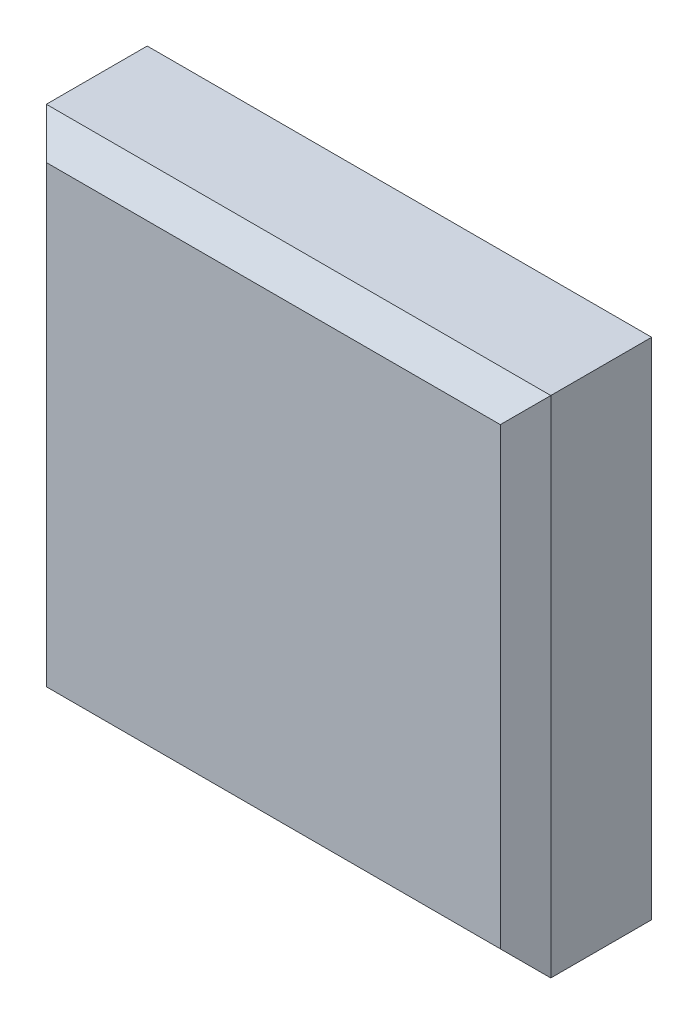
ISO-10303-21;
HEADER;
FILE_DESCRIPTION(('STEP AP214'),'2;1');
FILE_NAME('part.step','',(''),(''),'','','');
FILE_SCHEMA(('AUTOMOTIVE_DESIGN { 1 0 10303 214 1 1 1 1 }'));
ENDSEC;
DATA;
#1=APPLICATION_CONTEXT('core data for automotive mechanical design processes');
#2=APPLICATION_PROTOCOL_DEFINITION('international standard','automotive_design',2000,#1);
#3=PRODUCT_CONTEXT('',#1,'mechanical');
#4=PRODUCT('Part','Part','',(#3));
#5=PRODUCT_RELATED_PRODUCT_CATEGORY('part','',(#4));
#6=PRODUCT_DEFINITION_FORMATION('','',#4);
#7=PRODUCT_DEFINITION_CONTEXT('part definition',#1,'design');
#8=PRODUCT_DEFINITION('design','',#6,#7);
#9=PRODUCT_DEFINITION_SHAPE('','',#8);
#10=(LENGTH_UNIT() NAMED_UNIT(*) SI_UNIT(.MILLI.,.METRE.));
#11=(NAMED_UNIT(*) PLANE_ANGLE_UNIT() SI_UNIT($,.RADIAN.));
#12=(NAMED_UNIT(*) SI_UNIT($,.STERADIAN.) SOLID_ANGLE_UNIT());
#13=UNCERTAINTY_MEASURE_WITH_UNIT(LENGTH_MEASURE(1.E-05),#10,'distance_accuracy_value','');
#14=(GEOMETRIC_REPRESENTATION_CONTEXT(3) GLOBAL_UNCERTAINTY_ASSIGNED_CONTEXT((#13)) GLOBAL_UNIT_ASSIGNED_CONTEXT((#10,
#11,#12)) REPRESENTATION_CONTEXT('',''));
#15=CARTESIAN_POINT('',(0.,0.,0.));
#16=DIRECTION('',(0.,0.,1.));
#17=DIRECTION('',(1.,0.,0.));
#18=AXIS2_PLACEMENT_3D('',#15,#16,#17);
#19=CARTESIAN_POINT('',(0.,0.,5.));
#20=DIRECTION('',(1.,0.,0.));
#21=DIRECTION('',(0.,1.,0.));
#22=AXIS2_PLACEMENT_3D('',#19,#20,#21);
#23=PLANE('',#22);
#24=DIRECTION('',(0.,0.,-1.));
#25=VECTOR('',#24,1.);
#26=CARTESIAN_POINT('',(0.,-20.,5.));
#27=LINE('',#26,#25);
#28=CARTESIAN_POINT('',(0.,-20.,4.));
#29=VERTEX_POINT('',#28);
#30=CARTESIAN_POINT('',(0.,-20.,0.));
#31=VERTEX_POINT('',#30);
#32=EDGE_CURVE('E86',#29,#31,#27,.T.);
#33=ORIENTED_EDGE('',*,*,#32,.F.);
#34=DIRECTION('',(0.,1.,0.));
#35=VECTOR('',#34,1.);
#36=CARTESIAN_POINT('',(0.,0.,4.));
#37=LINE('',#36,#35);
#38=CARTESIAN_POINT('',(0.,0.,4.));
#39=VERTEX_POINT('',#38);
#40=EDGE_CURVE('E11',#29,#39,#37,.T.);
#41=ORIENTED_EDGE('',*,*,#40,.T.);
#42=DIRECTION('',(0.,0.,-1.));
#43=VECTOR('',#42,1.);
#44=CARTESIAN_POINT('',(0.,0.,5.));
#45=LINE('',#44,#43);
#46=CARTESIAN_POINT('',(0.,0.,0.));
#47=VERTEX_POINT('',#46);
#48=EDGE_CURVE('E106',#39,#47,#45,.T.);
#49=ORIENTED_EDGE('',*,*,#48,.T.);
#50=DIRECTION('',(0.,-1.,0.));
#51=VECTOR('',#50,1.);
#52=CARTESIAN_POINT('',(0.,0.,0.));
#53=LINE('',#52,#51);
#54=EDGE_CURVE('E101',#47,#31,#53,.T.);
#55=ORIENTED_EDGE('',*,*,#54,.T.);
#56=EDGE_LOOP('',(#33,#41,#49,#55));
#57=FACE_BOUND('',#56,.T.);
#58=ADVANCED_FACE('F34',(#57),#23,.F.);
#59=CARTESIAN_POINT('',(0.,-20.,5.));
#60=DIRECTION('',(0.,1.,0.));
#61=DIRECTION('',(0.,0.,1.));
#62=AXIS2_PLACEMENT_3D('',#59,#60,#61);
#63=PLANE('',#62);
#64=DIRECTION('',(0.,0.,-1.));
#65=VECTOR('',#64,1.);
#66=CARTESIAN_POINT('',(20.,-20.,5.));
#67=LINE('',#66,#65);
#68=CARTESIAN_POINT('',(20.,-20.,4.));
#69=VERTEX_POINT('',#68);
#70=CARTESIAN_POINT('',(20.,-20.,0.));
#71=VERTEX_POINT('',#70);
#72=EDGE_CURVE('E95',#69,#71,#67,.T.);
#73=ORIENTED_EDGE('',*,*,#72,.F.);
#74=DIRECTION('',(-1.,0.,0.));
#75=VECTOR('',#74,1.);
#76=CARTESIAN_POINT('',(0.,-20.,4.));
#77=LINE('',#76,#75);
#78=EDGE_CURVE('E43',#69,#29,#77,.T.);
#79=ORIENTED_EDGE('',*,*,#78,.T.);
#80=ORIENTED_EDGE('',*,*,#32,.T.);
#81=DIRECTION('',(1.,0.,0.));
#82=VECTOR('',#81,1.);
#83=CARTESIAN_POINT('',(0.,-20.,0.));
#84=LINE('',#83,#82);
#85=EDGE_CURVE('E89',#31,#71,#84,.T.);
#86=ORIENTED_EDGE('',*,*,#85,.T.);
#87=EDGE_LOOP('',(#73,#79,#80,#86));
#88=FACE_BOUND('',#87,.T.);
#89=ADVANCED_FACE('F88',(#88),#63,.F.);
#90=CARTESIAN_POINT('',(20.,0.,5.));
#91=DIRECTION('',(-1.,0.,0.));
#92=DIRECTION('',(0.,-1.,0.));
#93=AXIS2_PLACEMENT_3D('',#90,#91,#92);
#94=PLANE('',#93);
#95=DIRECTION('',(0.,0.,-1.));
#96=VECTOR('',#95,1.);
#97=CARTESIAN_POINT('',(20.,0.,5.));
#98=LINE('',#97,#96);
#99=CARTESIAN_POINT('',(20.,0.,4.));
#100=VERTEX_POINT('',#99);
#101=CARTESIAN_POINT('',(20.,0.,0.));
#102=VERTEX_POINT('',#101);
#103=EDGE_CURVE('E116',#100,#102,#98,.T.);
#104=ORIENTED_EDGE('',*,*,#103,.F.);
#105=DIRECTION('',(0.,-1.,0.));
#106=VECTOR('',#105,1.);
#107=CARTESIAN_POINT('',(20.,-20.,4.));
#108=LINE('',#107,#106);
#109=EDGE_CURVE('E58',#100,#69,#108,.T.);
#110=ORIENTED_EDGE('',*,*,#109,.T.);
#111=ORIENTED_EDGE('',*,*,#72,.T.);
#112=DIRECTION('',(0.,1.,0.));
#113=VECTOR('',#112,1.);
#114=CARTESIAN_POINT('',(20.,0.,0.));
#115=LINE('',#114,#113);
#116=EDGE_CURVE('E103',#71,#102,#115,.T.);
#117=ORIENTED_EDGE('',*,*,#116,.T.);
#118=EDGE_LOOP('',(#104,#110,#111,#117));
#119=FACE_BOUND('',#118,.T.);
#120=ADVANCED_FACE('F154',(#119),#94,.F.);
#121=CARTESIAN_POINT('',(0.,0.,5.));
#122=DIRECTION('',(0.,-1.,0.));
#123=DIRECTION('',(0.,0.,-1.));
#124=AXIS2_PLACEMENT_3D('',#121,#122,#123);
#125=PLANE('',#124);
#126=ORIENTED_EDGE('',*,*,#48,.F.);
#127=DIRECTION('',(1.,0.,0.));
#128=VECTOR('',#127,1.);
#129=CARTESIAN_POINT('',(20.,0.,4.));
#130=LINE('',#129,#128);
#131=EDGE_CURVE('E127',#39,#100,#130,.T.);
#132=ORIENTED_EDGE('',*,*,#131,.T.);
#133=ORIENTED_EDGE('',*,*,#103,.T.);
#134=DIRECTION('',(-1.,0.,0.));
#135=VECTOR('',#134,1.);
#136=CARTESIAN_POINT('',(0.,0.,0.));
#137=LINE('',#136,#135);
#138=EDGE_CURVE('E113',#102,#47,#137,.T.);
#139=ORIENTED_EDGE('',*,*,#138,.T.);
#140=EDGE_LOOP('',(#126,#132,#133,#139));
#141=FACE_BOUND('',#140,.T.);
#142=ADVANCED_FACE('F153',(#141),#125,.F.);
#143=CARTESIAN_POINT('',(0.,0.,5.));
#144=DIRECTION('',(0.,0.,1.));
#145=DIRECTION('',(1.,0.,0.));
#146=AXIS2_PLACEMENT_3D('',#143,#144,#145);
#147=PLANE('',#146);
#148=DIRECTION('',(0.,1.,0.));
#149=VECTOR('',#148,1.);
#150=CARTESIAN_POINT('',(19.,0.,5.));
#151=LINE('',#150,#149);
#152=CARTESIAN_POINT('',(19.,-19.,5.));
#153=VERTEX_POINT('',#152);
#154=CARTESIAN_POINT('',(19.,-1.,5.));
#155=VERTEX_POINT('',#154);
#156=EDGE_CURVE('E122',#153,#155,#151,.T.);
#157=ORIENTED_EDGE('',*,*,#156,.T.);
#158=DIRECTION('',(-1.,0.,0.));
#159=VECTOR('',#158,1.);
#160=CARTESIAN_POINT('',(0.,-1.,5.));
#161=LINE('',#160,#159);
#162=CARTESIAN_POINT('',(1.,-1.,5.));
#163=VERTEX_POINT('',#162);
#164=EDGE_CURVE('E124',#155,#163,#161,.T.);
#165=ORIENTED_EDGE('',*,*,#164,.T.);
#166=DIRECTION('',(0.,-1.,0.));
#167=VECTOR('',#166,1.);
#168=CARTESIAN_POINT('',(1.,-20.,5.));
#169=LINE('',#168,#167);
#170=CARTESIAN_POINT('',(1.,-19.,5.));
#171=VERTEX_POINT('',#170);
#172=EDGE_CURVE('E94',#163,#171,#169,.T.);
#173=ORIENTED_EDGE('',*,*,#172,.T.);
#174=DIRECTION('',(1.,0.,0.));
#175=VECTOR('',#174,1.);
#176=CARTESIAN_POINT('',(20.,-19.,5.));
#177=LINE('',#176,#175);
#178=EDGE_CURVE('E120',#171,#153,#177,.T.);
#179=ORIENTED_EDGE('',*,*,#178,.T.);
#180=EDGE_LOOP('',(#157,#165,#173,#179));
#181=FACE_BOUND('',#180,.T.);
#182=ADVANCED_FACE('F146',(#181),#147,.T.);
#183=CARTESIAN_POINT('',(0.,0.,0.));
#184=DIRECTION('',(0.,0.,1.));
#185=DIRECTION('',(1.,0.,0.));
#186=AXIS2_PLACEMENT_3D('',#183,#184,#185);
#187=PLANE('',#186);
#188=ORIENTED_EDGE('',*,*,#54,.F.);
#189=ORIENTED_EDGE('',*,*,#138,.F.);
#190=ORIENTED_EDGE('',*,*,#116,.F.);
#191=ORIENTED_EDGE('',*,*,#85,.F.);
#192=EDGE_LOOP('',(#188,#189,#190,#191));
#193=FACE_BOUND('',#192,.T.);
#194=ADVANCED_FACE('F99',(#193),#187,.F.);
#195=CARTESIAN_POINT('',(0.,-19.,5.));
#196=DIRECTION('',(0.,-0.707106781186549,0.707106781186546));
#197=DIRECTION('',(-1.,0.,0.));
#198=AXIS2_PLACEMENT_3D('',#195,#196,#197);
#199=PLANE('',#198);
#200=DIRECTION('',(0.577350269189625,0.577350269189625,0.577350269189627));
#201=VECTOR('',#200,1.);
#202=CARTESIAN_POINT('',(7.33333333333332,-12.6666666666667,11.3333333333333));
#203=LINE('',#202,#201);
#204=EDGE_CURVE('E110',#29,#171,#203,.T.);
#205=ORIENTED_EDGE('',*,*,#204,.F.);
#206=ORIENTED_EDGE('',*,*,#78,.F.);
#207=DIRECTION('',(-0.577350269189624,0.577350269189626,0.577350269189628));
#208=VECTOR('',#207,1.);
#209=CARTESIAN_POINT('',(12.6666666666667,-12.6666666666667,11.3333333333333));
#210=LINE('',#209,#208);
#211=EDGE_CURVE('E38',#153,#69,#210,.F.);
#212=ORIENTED_EDGE('',*,*,#211,.F.);
#213=ORIENTED_EDGE('',*,*,#178,.F.);
#214=EDGE_LOOP('',(#205,#206,#212,#213));
#215=FACE_BOUND('',#214,.T.);
#216=ADVANCED_FACE('F36',(#215),#199,.T.);
#217=CARTESIAN_POINT('',(19.,0.,5.));
#218=DIRECTION('',(0.70710678118655,0.,0.707106781186545));
#219=DIRECTION('',(0.,-1.,0.));
#220=AXIS2_PLACEMENT_3D('',#217,#218,#219);
#221=PLANE('',#220);
#222=ORIENTED_EDGE('',*,*,#211,.T.);
#223=ORIENTED_EDGE('',*,*,#109,.F.);
#224=DIRECTION('',(-0.577350269189624,-0.577350269189626,0.577350269189628));
#225=VECTOR('',#224,1.);
#226=CARTESIAN_POINT('',(19.3333333333333,-0.666666666666666,4.66666666666666));
#227=LINE('',#226,#225);
#228=EDGE_CURVE('E134',#155,#100,#227,.F.);
#229=ORIENTED_EDGE('',*,*,#228,.F.);
#230=ORIENTED_EDGE('',*,*,#156,.F.);
#231=EDGE_LOOP('',(#222,#223,#229,#230));
#232=FACE_BOUND('',#231,.T.);
#233=ADVANCED_FACE('F171',(#232),#221,.T.);
#234=CARTESIAN_POINT('',(1.,0.,5.));
#235=DIRECTION('',(-0.707106781186549,0.,0.707106781186546));
#236=DIRECTION('',(0.,1.,0.));
#237=AXIS2_PLACEMENT_3D('',#234,#235,#236);
#238=PLANE('',#237);
#239=ORIENTED_EDGE('',*,*,#204,.T.);
#240=ORIENTED_EDGE('',*,*,#172,.F.);
#241=DIRECTION('',(-0.577350269189625,0.577350269189625,-0.577350269189627));
#242=VECTOR('',#241,1.);
#243=CARTESIAN_POINT('',(0.666666666666668,-0.666666666666668,4.66666666666667));
#244=LINE('',#243,#242);
#245=EDGE_CURVE('E132',#39,#163,#244,.F.);
#246=ORIENTED_EDGE('',*,*,#245,.F.);
#247=ORIENTED_EDGE('',*,*,#40,.F.);
#248=EDGE_LOOP('',(#239,#240,#246,#247));
#249=FACE_BOUND('',#248,.T.);
#250=ADVANCED_FACE('F139',(#249),#238,.T.);
#251=CARTESIAN_POINT('',(0.,-1.,5.));
#252=DIRECTION('',(0.,0.707106781186549,0.707106781186546));
#253=DIRECTION('',(1.,0.,0.));
#254=AXIS2_PLACEMENT_3D('',#251,#252,#253);
#255=PLANE('',#254);
#256=ORIENTED_EDGE('',*,*,#228,.T.);
#257=ORIENTED_EDGE('',*,*,#131,.F.);
#258=ORIENTED_EDGE('',*,*,#245,.T.);
#259=ORIENTED_EDGE('',*,*,#164,.F.);
#260=EDGE_LOOP('',(#256,#257,#258,#259));
#261=FACE_BOUND('',#260,.T.);
#262=ADVANCED_FACE('F150',(#261),#255,.T.);
#263=CLOSED_SHELL('',(#58,#89,#120,#142,#182,#194,#216,#233,#250,#262));
#264=MANIFOLD_SOLID_BREP('B2',#263);
#265=ADVANCED_BREP_SHAPE_REPRESENTATION('',(#18,#264),#14);
#266=SHAPE_DEFINITION_REPRESENTATION(#9,#265);
ENDSEC;
END-ISO-10303-21;
